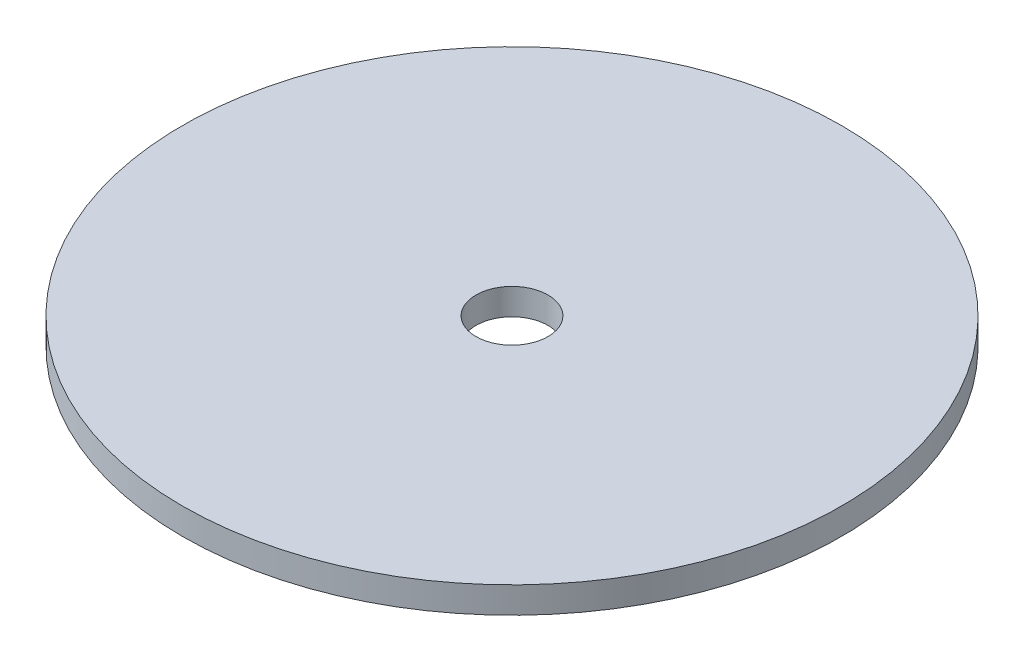
ISO-10303-21;
HEADER;
FILE_DESCRIPTION(('STEP AP214'),'2;1');
FILE_NAME('part.step','',(''),(''),'','','');
FILE_SCHEMA(('AUTOMOTIVE_DESIGN { 1 0 10303 214 1 1 1 1 }'));
ENDSEC;
DATA;
#1=APPLICATION_CONTEXT('core data for automotive mechanical design processes');
#2=APPLICATION_PROTOCOL_DEFINITION('international standard','automotive_design',2000,#1);
#3=PRODUCT_CONTEXT('',#1,'mechanical');
#4=PRODUCT('Part','Part','',(#3));
#5=PRODUCT_RELATED_PRODUCT_CATEGORY('part','',(#4));
#6=PRODUCT_DEFINITION_FORMATION('','',#4);
#7=PRODUCT_DEFINITION_CONTEXT('part definition',#1,'design');
#8=PRODUCT_DEFINITION('design','',#6,#7);
#9=PRODUCT_DEFINITION_SHAPE('','',#8);
#10=(LENGTH_UNIT() NAMED_UNIT(*) SI_UNIT(.MILLI.,.METRE.));
#11=(NAMED_UNIT(*) PLANE_ANGLE_UNIT() SI_UNIT($,.RADIAN.));
#12=(NAMED_UNIT(*) SI_UNIT($,.STERADIAN.) SOLID_ANGLE_UNIT());
#13=UNCERTAINTY_MEASURE_WITH_UNIT(LENGTH_MEASURE(1.E-05),#10,'distance_accuracy_value','');
#14=(GEOMETRIC_REPRESENTATION_CONTEXT(3) GLOBAL_UNCERTAINTY_ASSIGNED_CONTEXT((#13)) GLOBAL_UNIT_ASSIGNED_CONTEXT((#10,
#11,#12)) REPRESENTATION_CONTEXT('',''));
#15=CARTESIAN_POINT('',(0.,0.,0.));
#16=DIRECTION('',(0.,0.,1.));
#17=DIRECTION('',(1.,0.,0.));
#18=AXIS2_PLACEMENT_3D('',#15,#16,#17);
#19=CARTESIAN_POINT('',(0.,3.,0.));
#20=DIRECTION('',(0.,1.,0.));
#21=DIRECTION('',(0.,0.,1.));
#22=AXIS2_PLACEMENT_3D('',#19,#20,#21);
#23=PLANE('',#22);
#24=CARTESIAN_POINT('',(0.,3.,0.));
#25=DIRECTION('',(0.,1.,0.));
#26=DIRECTION('',(0.,0.,1.));
#27=AXIS2_PLACEMENT_3D('',#24,#25,#26);
#28=CIRCLE('',#27,37.5);
#29=CARTESIAN_POINT('',(0.,3.,37.5));
#30=VERTEX_POINT('',#29);
#31=EDGE_CURVE('E10',#30,#30,#28,.T.);
#32=ORIENTED_EDGE('',*,*,#31,.T.);
#33=EDGE_LOOP('',(#32));
#34=FACE_BOUND('',#33,.T.);
#35=CARTESIAN_POINT('',(0.,3.,0.));
#36=DIRECTION('',(0.,1.,0.));
#37=DIRECTION('',(0.,0.,1.));
#38=AXIS2_PLACEMENT_3D('',#35,#36,#37);
#39=CIRCLE('',#38,4.1);
#40=CARTESIAN_POINT('',(0.,3.,4.1));
#41=VERTEX_POINT('',#40);
#42=EDGE_CURVE('E42',#41,#41,#39,.T.);
#43=ORIENTED_EDGE('',*,*,#42,.F.);
#44=EDGE_LOOP('',(#43));
#45=FACE_BOUND('',#44,.T.);
#46=ADVANCED_FACE('F31',(#34,#45),#23,.T.);
#47=CARTESIAN_POINT('',(0.,0.,0.));
#48=DIRECTION('',(0.,1.,0.));
#49=DIRECTION('',(0.,0.,1.));
#50=AXIS2_PLACEMENT_3D('',#47,#48,#49);
#51=PLANE('',#50);
#52=CARTESIAN_POINT('',(0.,0.,0.));
#53=DIRECTION('',(0.,1.,0.));
#54=DIRECTION('',(0.,0.,1.));
#55=AXIS2_PLACEMENT_3D('',#52,#53,#54);
#56=CIRCLE('',#55,37.5);
#57=CARTESIAN_POINT('',(0.,0.,37.5));
#58=VERTEX_POINT('',#57);
#59=EDGE_CURVE('E35',#58,#58,#56,.T.);
#60=ORIENTED_EDGE('',*,*,#59,.F.);
#61=EDGE_LOOP('',(#60));
#62=FACE_BOUND('',#61,.T.);
#63=CARTESIAN_POINT('',(0.,0.,0.));
#64=DIRECTION('',(0.,1.,0.));
#65=DIRECTION('',(0.,0.,1.));
#66=AXIS2_PLACEMENT_3D('',#63,#64,#65);
#67=CIRCLE('',#66,4.1);
#68=CARTESIAN_POINT('',(0.,0.,4.1));
#69=VERTEX_POINT('',#68);
#70=EDGE_CURVE('E44',#69,#69,#67,.T.);
#71=ORIENTED_EDGE('',*,*,#70,.T.);
#72=EDGE_LOOP('',(#71));
#73=FACE_BOUND('',#72,.T.);
#74=ADVANCED_FACE('F54',(#62,#73),#51,.F.);
#75=CARTESIAN_POINT('',(0.,3.,0.));
#76=DIRECTION('',(0.,-1.,0.));
#77=DIRECTION('',(0.,0.,-1.));
#78=AXIS2_PLACEMENT_3D('',#75,#76,#77);
#79=CYLINDRICAL_SURFACE('',#78,37.5);
#80=ORIENTED_EDGE('',*,*,#31,.F.);
#81=EDGE_LOOP('',(#80));
#82=FACE_BOUND('',#81,.T.);
#83=ORIENTED_EDGE('',*,*,#59,.T.);
#84=EDGE_LOOP('',(#83));
#85=FACE_BOUND('',#84,.T.);
#86=ADVANCED_FACE('F33',(#82,#85),#79,.T.);
#87=CARTESIAN_POINT('',(0.,3.,0.));
#88=DIRECTION('',(0.,-1.,0.));
#89=DIRECTION('',(0.,0.,-1.));
#90=AXIS2_PLACEMENT_3D('',#87,#88,#89);
#91=CYLINDRICAL_SURFACE('',#90,4.1);
#92=ORIENTED_EDGE('',*,*,#42,.T.);
#93=EDGE_LOOP('',(#92));
#94=FACE_BOUND('',#93,.T.);
#95=ORIENTED_EDGE('',*,*,#70,.F.);
#96=EDGE_LOOP('',(#95));
#97=FACE_BOUND('',#96,.T.);
#98=ADVANCED_FACE('F50',(#94,#97),#91,.F.);
#99=CLOSED_SHELL('',(#46,#74,#86,#98));
#100=MANIFOLD_SOLID_BREP('B2',#99);
#101=ADVANCED_BREP_SHAPE_REPRESENTATION('',(#18,#100),#14);
#102=SHAPE_DEFINITION_REPRESENTATION(#9,#101);
ENDSEC;
END-ISO-10303-21;
